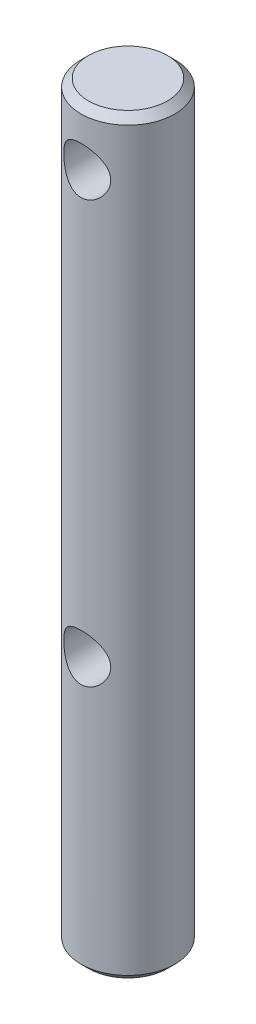
ISO-10303-21;
HEADER;
FILE_DESCRIPTION(('STEP AP214'),'2;1');
FILE_NAME('part.step','',(''),(''),'','','');
FILE_SCHEMA(('AUTOMOTIVE_DESIGN { 1 0 10303 214 1 1 1 1 }'));
ENDSEC;
DATA;
#1=APPLICATION_CONTEXT('core data for automotive mechanical design processes');
#2=APPLICATION_PROTOCOL_DEFINITION('international standard','automotive_design',2000,#1);
#3=PRODUCT_CONTEXT('',#1,'mechanical');
#4=PRODUCT('Part','Part','',(#3));
#5=PRODUCT_RELATED_PRODUCT_CATEGORY('part','',(#4));
#6=PRODUCT_DEFINITION_FORMATION('','',#4);
#7=PRODUCT_DEFINITION_CONTEXT('part definition',#1,'design');
#8=PRODUCT_DEFINITION('design','',#6,#7);
#9=PRODUCT_DEFINITION_SHAPE('','',#8);
#10=(LENGTH_UNIT() NAMED_UNIT(*) SI_UNIT(.MILLI.,.METRE.));
#11=(NAMED_UNIT(*) PLANE_ANGLE_UNIT() SI_UNIT($,.RADIAN.));
#12=(NAMED_UNIT(*) SI_UNIT($,.STERADIAN.) SOLID_ANGLE_UNIT());
#13=UNCERTAINTY_MEASURE_WITH_UNIT(LENGTH_MEASURE(1.E-05),#10,'distance_accuracy_value','');
#14=(GEOMETRIC_REPRESENTATION_CONTEXT(3) GLOBAL_UNCERTAINTY_ASSIGNED_CONTEXT((#13)) GLOBAL_UNIT_ASSIGNED_CONTEXT((#10,
#11,#12)) REPRESENTATION_CONTEXT('',''));
#15=CARTESIAN_POINT('',(0.,0.,0.));
#16=DIRECTION('',(0.,0.,1.));
#17=DIRECTION('',(1.,0.,0.));
#18=AXIS2_PLACEMENT_3D('',#15,#16,#17);
#19=CARTESIAN_POINT('',(0.,50.8,0.));
#20=DIRECTION('',(0.,-1.,0.));
#21=DIRECTION('',(0.,0.,-1.));
#22=AXIS2_PLACEMENT_3D('',#19,#20,#21);
#23=CYLINDRICAL_SURFACE('',#22,3.175);
#24=CARTESIAN_POINT('',(0.,48.5775,-3.175));
#25=CARTESIAN_POINT('',(-0.083457991185083,48.5774947575715,-3.17499545030503));
#26=CARTESIAN_POINT('',(-0.167015477019881,48.5708800089203,-3.17167404493863));
#27=CARTESIAN_POINT('',(-0.331660873489373,48.5447135524578,-3.15871472708987));
#28=CARTESIAN_POINT('',(-0.412743787657887,48.525137276116,-3.1490648192841));
#29=CARTESIAN_POINT('',(-0.569807002497712,48.4740048288211,-3.12445843552858));
#30=CARTESIAN_POINT('',(-0.645805799665895,48.4424952150063,-3.10952259694341));
#31=CARTESIAN_POINT('',(-0.791325279180476,48.3686316385831,-3.07571420218771));
#32=CARTESIAN_POINT('',(-0.860846471709219,48.3262785310049,-3.05684195643221));
#33=CARTESIAN_POINT('',(-0.996168660697032,48.2290163664421,-3.01555559984673));
#34=CARTESIAN_POINT('',(-1.06149014765635,48.1735027142071,-2.99299628614965));
#35=CARTESIAN_POINT('',(-1.18233736872633,48.0527971516953,-2.94735202766705));
#36=CARTESIAN_POINT('',(-1.23785563818199,47.9875979353112,-2.92426669731842));
#37=CARTESIAN_POINT('',(-1.34183755071482,47.8433076826316,-2.87812085025789));
#38=CARTESIAN_POINT('',(-1.38942022018823,47.7635314438759,-2.85520109315084));
#39=CARTESIAN_POINT('',(-1.47029206018898,47.5958418541219,-2.81441491301059));
#40=CARTESIAN_POINT('',(-1.50359144125905,47.5079343706526,-2.79654488326096));
#41=CARTESIAN_POINT('',(-1.55278525197438,47.3318441451427,-2.76951863922521));
#42=CARTESIAN_POINT('',(-1.5696022981152,47.243992932343,-2.75990481139145));
#43=CARTESIAN_POINT('',(-1.58817785187779,47.0662335950251,-2.74926250293288));
#44=CARTESIAN_POINT('',(-1.58995124029225,46.976327591367,-2.7482255383247));
#45=CARTESIAN_POINT('',(-1.57906606838602,46.8085709363994,-2.75448601783382));
#46=CARTESIAN_POINT('',(-1.5681079882647,46.7305643504334,-2.76080162313447));
#47=CARTESIAN_POINT('',(-1.53501701037788,46.5776914688703,-2.77933513114987));
#48=CARTESIAN_POINT('',(-1.51288055293752,46.5028261818278,-2.79155491395445));
#49=CARTESIAN_POINT('',(-1.45765802636278,46.356223752052,-2.82078868805227));
#50=CARTESIAN_POINT('',(-1.42432891904664,46.2846000919276,-2.83790772054098));
#51=CARTESIAN_POINT('',(-1.34785367917295,46.1476180605134,-2.87501654296729));
#52=CARTESIAN_POINT('',(-1.30470313705229,46.0822625222348,-2.89500762088553));
#53=CARTESIAN_POINT('',(-1.20342986217405,45.9509475112701,-2.93867138171466));
#54=CARTESIAN_POINT('',(-1.14410245266123,45.8859622131978,-2.96248947500834));
#55=CARTESIAN_POINT('',(-1.01529448125193,45.7664575229869,-3.00906851989396));
#56=CARTESIAN_POINT('',(-0.945809094811676,45.7119431326462,-3.03182896234596));
#57=CARTESIAN_POINT('',(-0.794569953008056,45.6125490131153,-3.07501904811705));
#58=CARTESIAN_POINT('',(-0.712396326664058,45.5682342499924,-3.09529137357187));
#59=CARTESIAN_POINT('',(-0.540490117088461,45.4944209663942,-3.12988136279972));
#60=CARTESIAN_POINT('',(-0.450763602321123,45.4649106812884,-3.14420375322891));
#61=CARTESIAN_POINT('',(-0.274266805511363,45.4239702965998,-3.16427379814529));
#62=CARTESIAN_POINT('',(-0.187867179745466,45.411245163252,-3.1706333955333));
#63=CARTESIAN_POINT('',(-0.013937614919594,45.400174739324,-3.17615908866327));
#64=CARTESIAN_POINT('',(0.0735917690434815,45.4018226365473,-3.17532859220093));
#65=CARTESIAN_POINT('',(0.240082343027755,45.4187031178648,-3.16692267702328));
#66=CARTESIAN_POINT('',(0.319181810279265,45.4328728957089,-3.15987502529967));
#67=CARTESIAN_POINT('',(0.473720941529333,45.4727279391335,-3.14042696962309));
#68=CARTESIAN_POINT('',(0.549160201034602,45.4984144742449,-3.12802597555879));
#69=CARTESIAN_POINT('',(0.696735665913698,45.5612475654624,-3.09854999119071));
#70=CARTESIAN_POINT('',(0.768715755246715,45.5987007920596,-3.08135149809289));
#71=CARTESIAN_POINT('',(0.905607411697596,45.6836582128389,-3.043935592289));
#72=CARTESIAN_POINT('',(0.970515949770341,45.7311666886702,-3.02371689462514));
#73=CARTESIAN_POINT('',(1.09818120674663,45.8402696752125,-2.97986801371214));
#74=CARTESIAN_POINT('',(1.16010067353771,45.9027893036567,-2.95609779689055));
#75=CARTESIAN_POINT('',(1.27294690977618,46.0373811776534,-2.90929046679002));
#76=CARTESIAN_POINT('',(1.3238660748176,46.1094599761711,-2.88625386997575));
#77=CARTESIAN_POINT('',(1.41558631423544,46.2655343009996,-2.84243767627802));
#78=CARTESIAN_POINT('',(1.45577797458289,46.349937884925,-2.82182140722634));
#79=CARTESIAN_POINT('',(1.52095648617134,46.5256722322753,-2.78723839766939));
#80=CARTESIAN_POINT('',(1.54596292893889,46.6169938982662,-2.77326309427028));
#81=CARTESIAN_POINT('',(1.57775542885366,46.7945949788295,-2.75528882878461));
#82=CARTESIAN_POINT('',(1.58606013179365,46.8805168773284,-2.75046096250791));
#83=CARTESIAN_POINT('',(1.58859403257222,47.0526222191237,-2.74900000493545));
#84=CARTESIAN_POINT('',(1.5828293315144,47.1388055328714,-2.75236336156894));
#85=CARTESIAN_POINT('',(1.55880772437938,47.3003300586843,-2.76602606006084));
#86=CARTESIAN_POINT('',(1.54179319901956,47.3759219963548,-2.7756341249122));
#87=CARTESIAN_POINT('',(1.49729088118125,47.5230953895862,-2.79988988197899));
#88=CARTESIAN_POINT('',(1.46979971971637,47.5946755465711,-2.81453919516849));
#89=CARTESIAN_POINT('',(1.40305749566464,47.7371169509411,-2.84842791953701));
#90=CARTESIAN_POINT('',(1.36314043128242,47.8076067941536,-2.86790959303524));
#91=CARTESIAN_POINT('',(1.27341466747435,47.9413483261878,-2.90886088970341));
#92=CARTESIAN_POINT('',(1.22360082184597,48.0045962222023,-2.93033154400532));
#93=CARTESIAN_POINT('',(1.10839778107492,48.130050396988,-2.97596438013471));
#94=CARTESIAN_POINT('',(1.04185152150814,48.1911963249811,-3.00013660999272));
#95=CARTESIAN_POINT('',(0.898770754895197,48.3016924862035,-3.0460593171264));
#96=CARTESIAN_POINT('',(0.822230898247,48.3510363614085,-3.06780848569085));
#97=CARTESIAN_POINT('',(0.660291409892928,48.4365877258054,-3.10670590186878));
#98=CARTESIAN_POINT('',(0.574832962245561,48.4726998686629,-3.12382053184118));
#99=CARTESIAN_POINT('',(0.398053085556713,48.5295704663149,-3.15120879312142));
#100=CARTESIAN_POINT('',(0.306749131847696,48.5503725568041,-3.1615018583887));
#101=CARTESIAN_POINT('',(0.178755590054295,48.5678121400986,-3.17016545787646));
#102=CARTESIAN_POINT('',(0.143131983613484,48.5714399423753,-3.17197367477648));
#103=CARTESIAN_POINT('',(0.0716783742405832,48.5762850315036,-3.17439193950695));
#104=CARTESIAN_POINT('',(0.0358483656390228,48.5775022518214,-3.17500195426617));
#105=CARTESIAN_POINT('',(0.,48.5775,-3.175));
#106=B_SPLINE_CURVE_WITH_KNOTS('',3,(#24,#25,#26,#27,#28,#29,#30,#31,#32,#33,#34,#35,#36,#37,
#38,#39,#40,#41,#42,#43,#44,#45,#46,#47,#48,#49,#50,#51,#52,#53,#54,#55,#56,#57,#58,#59,#60,#61,
#62,#63,#64,#65,#66,#67,#68,#69,#70,#71,#72,#73,#74,#75,#76,#77,#78,#79,#80,#81,#82,#83,#84,#85,
#86,#87,#88,#89,#90,#91,#92,#93,#94,#95,#96,#97,#98,#99,#100,#101,#102,#103,#104,#105),
.UNSPECIFIED.,.T.,.F.,(4,2,2,2,2,2,2,2,2,2,2,2,2,2,2,2,2,2,2,2,2,2,2,2,2,2,2,2,2,2,2,2,2,2,2,2,
2,2,2,2,4),(0.,0.250228508654714,0.500932687663352,0.750668671844023,1.00038496992324,
1.26520854196497,1.53023290227578,1.8158099070882,2.10118242288521,2.36947094272614,
2.63749404759819,2.87346568449796,3.10951251232015,3.35105756267474,3.59271127500602,
3.86500594367532,4.13743036175415,4.42250547765424,4.70735369348243,4.96860973623261,
5.22974196161968,5.47063464078468,5.71155388089103,5.95936158944289,6.20727503062988,
6.47953381898015,6.75198021926997,7.03762057931739,7.32289162713402,7.58077775661086,
7.83855207535177,8.07176964270058,8.30506226951507,8.55402875138706,8.80312503315514,
9.08248822877009,9.36200158617726,9.64349121690847,9.92417542436073,10.0316550721259,
10.1391376863632),.UNSPECIFIED.);
#107=CARTESIAN_POINT('',(0.,48.5775,-3.175));
#108=VERTEX_POINT('',#107);
#109=EDGE_CURVE('E39',#108,#108,#106,.T.);
#110=ORIENTED_EDGE('',*,*,#109,.T.);
#111=EDGE_LOOP('',(#110));
#112=FACE_BOUND('',#111,.T.);
#113=CARTESIAN_POINT('',(1.5875,46.99,2.74963065701559));
#114=CARTESIAN_POINT('',(1.58749422638082,46.90727885449,2.74963786381429));
#115=CARTESIAN_POINT('',(1.58099120353898,46.824453259204,2.75342034385563));
#116=CARTESIAN_POINT('',(1.55531059571316,46.661344217325,2.76800256742633));
#117=CARTESIAN_POINT('',(1.53610637747976,46.5810664848686,2.77881705563201));
#118=CARTESIAN_POINT('',(1.48605866856095,46.425720482854,2.8058958773607));
#119=CARTESIAN_POINT('',(1.4552770495838,46.3506269891982,2.82213119013788));
#120=CARTESIAN_POINT('',(1.38313719653499,46.2066890793302,2.85817730396762));
#121=CARTESIAN_POINT('',(1.34177839028179,46.1378450014584,2.87798829843252));
#122=CARTESIAN_POINT('',(1.24565813309277,46.002089655915,2.92095029628688));
#123=CARTESIAN_POINT('',(1.19007260737824,45.9358061221183,2.94424201025251));
#124=CARTESIAN_POINT('',(1.06879041958797,45.8130141834043,2.99040522672308));
#125=CARTESIAN_POINT('',(1.00308874467939,45.7565106543987,3.01327651457109));
#126=CARTESIAN_POINT('',(0.858027181920594,45.6511546475531,3.05786594662806));
#127=CARTESIAN_POINT('',(0.778045162557466,45.603074643523,3.07940243938849));
#128=CARTESIAN_POINT('',(0.609849279726715,45.5213388954723,3.11706825308002));
#129=CARTESIAN_POINT('',(0.521640654294323,45.4876740483822,3.1332009850419));
#130=CARTESIAN_POINT('',(0.346146348482491,45.4382113501845,3.15722732225227));
#131=CARTESIAN_POINT('',(0.259241592401001,45.4213126269106,3.16562549850666));
#132=CARTESIAN_POINT('',(0.0834558730578376,45.4022362866034,3.17512039355631));
#133=CARTESIAN_POINT('',(-0.0054238617769311,45.4000497623368,3.17622153020536));
#134=CARTESIAN_POINT('',(-0.1743591325227,45.4100353449279,3.17123733792365));
#135=CARTESIAN_POINT('',(-0.254509903693154,45.4209753496399,3.16576862228805));
#136=CARTESIAN_POINT('',(-0.411660612920334,45.4546983396986,3.14919114349849));
#137=CARTESIAN_POINT('',(-0.488660314736604,45.4774822112498,3.138081958304));
#138=CARTESIAN_POINT('',(-0.638666159116664,45.5343935736676,3.11104888469151));
#139=CARTESIAN_POINT('',(-0.711602309830344,45.5686736471607,3.09506050927604));
#140=CARTESIAN_POINT('',(-0.850863172402407,45.6473931732199,3.05971013003866));
#141=CARTESIAN_POINT('',(-0.917185505031348,45.6918362629925,3.04034691900006));
#142=CARTESIAN_POINT('',(-1.04802568667588,45.7944463705587,2.99790476108776));
#143=CARTESIAN_POINT('',(-1.1117803441091,45.8535135574675,2.97464759397103));
#144=CARTESIAN_POINT('',(-1.22889068784772,45.9812861883266,2.92821265681564));
#145=CARTESIAN_POINT('',(-1.28223837337409,46.0499989784851,2.90503496121686));
#146=CARTESIAN_POINT('',(-1.38033971874451,46.2004540054732,2.85978847796819));
#147=CARTESIAN_POINT('',(-1.42433248752765,46.2827465615986,2.83788357985248));
#148=CARTESIAN_POINT('',(-1.49751909188945,46.4549135532824,2.79996027317239));
#149=CARTESIAN_POINT('',(-1.52672836990979,46.5447799624154,2.78393572698132));
#150=CARTESIAN_POINT('',(-1.56714858500225,46.7220530366614,2.76137109359542));
#151=CARTESIAN_POINT('',(-1.57960238136546,46.8090902764816,2.75418003659488));
#152=CARTESIAN_POINT('',(-1.58990815274564,46.9842871296575,2.74824696986555));
#153=CARTESIAN_POINT('',(-1.5877704422376,47.0724459062277,2.74949899186782));
#154=CARTESIAN_POINT('',(-1.57009471880854,47.2371005957437,2.75962009258178));
#155=CARTESIAN_POINT('',(-1.55604815903104,47.3138173786338,2.76764095166814));
#156=CARTESIAN_POINT('',(-1.517167851854,47.4636588607051,2.78914259212754));
#157=CARTESIAN_POINT('',(-1.49233061106499,47.5367823880602,2.80262514157991));
#158=CARTESIAN_POINT('',(-1.43136554691026,47.681215487808,2.83426252551455));
#159=CARTESIAN_POINT('',(-1.3947680761122,47.752284189255,2.85260483648363));
#160=CARTESIAN_POINT('',(-1.31173071412509,47.8876824685682,2.89172839701884));
#161=CARTESIAN_POINT('',(-1.26528576687739,47.9520085590773,2.91251089701297));
#162=CARTESIAN_POINT('',(-1.15702900292818,48.0805787934436,2.95732197549433));
#163=CARTESIAN_POINT('',(-1.09401811980001,48.1437904767643,2.98142950757434));
#164=CARTESIAN_POINT('',(-0.957904636444784,48.2590669278148,3.02790598027404));
#165=CARTESIAN_POINT('',(-0.884798641015365,48.311127930241,3.05027433199738));
#166=CARTESIAN_POINT('',(-0.727924888062029,48.4037857899458,3.09151911684394));
#167=CARTESIAN_POINT('',(-0.643926667398906,48.4440438251598,3.11028781154346));
#168=CARTESIAN_POINT('',(-0.469141753867718,48.5094564223736,3.1413982599789));
#169=CARTESIAN_POINT('',(-0.37836110096008,48.534624246544,3.15374565586242));
#170=CARTESIAN_POINT('',(-0.201580245699537,48.5669725956273,3.16972169238739));
#171=CARTESIAN_POINT('',(-0.1159056671126,48.5755916279533,3.17404635554254));
#172=CARTESIAN_POINT('',(0.0557625026975351,48.5788386839089,3.17566881970521));
#173=CARTESIAN_POINT('',(0.141755971718449,48.5734716052811,3.17296908056188));
#174=CARTESIAN_POINT('',(0.30565406280347,48.5498514542119,3.16125175530202));
#175=CARTESIAN_POINT('',(0.383718304525382,48.5324708018034,3.15266220285434));
#176=CARTESIAN_POINT('',(0.535695449091493,48.4864933886065,3.13042448690684));
#177=CARTESIAN_POINT('',(0.609607754866869,48.4578950193516,3.11677559798313));
#178=CARTESIAN_POINT('',(0.754734657413753,48.3890208046865,3.08492415062641));
#179=CARTESIAN_POINT('',(0.825698664036324,48.3482978244075,3.06655179803093));
#180=CARTESIAN_POINT('',(0.960079743879765,48.2568917847613,3.02717411362649));
#181=CARTESIAN_POINT('',(1.02349332927116,48.2062041507789,3.00616757411397));
#182=CARTESIAN_POINT('',(1.14762598159906,48.0904595418015,2.96114168734771));
#183=CARTESIAN_POINT('',(1.20744882420609,48.0244745511299,2.93703055931071));
#184=CARTESIAN_POINT('',(1.31550296873904,47.8830469802065,2.89025133408528));
#185=CARTESIAN_POINT('',(1.36372401564097,47.8075961218726,2.86758452646961));
#186=CARTESIAN_POINT('',(1.44848433915973,47.6462143235527,2.82574373421554));
#187=CARTESIAN_POINT('',(1.48460629221299,47.5600275443331,2.80670276631829));
#188=CARTESIAN_POINT('',(1.54126995134143,47.3815848081106,2.77600023171258));
#189=CARTESIAN_POINT('',(1.56186376599086,47.2893502888511,2.76431400634477));
#190=CARTESIAN_POINT('',(1.57855762498476,47.1617589979024,2.75477720255342));
#191=CARTESIAN_POINT('',(1.58190581663011,47.1275284676434,2.75285404795678));
#192=CARTESIAN_POINT('',(1.58637828058031,47.0588713369169,2.75027923221803));
#193=CARTESIAN_POINT('',(1.58750240410979,47.0244447234874,2.74962765613611));
#194=CARTESIAN_POINT('',(1.5875,46.99,2.74963065701559));
#195=B_SPLINE_CURVE_WITH_KNOTS('',3,(#113,#114,#115,#116,#117,#118,#119,#120,#121,#122,#123,
#124,#125,#126,#127,#128,#129,#130,#131,#132,#133,#134,#135,#136,#137,#138,#139,#140,#141,#142,
#143,#144,#145,#146,#147,#148,#149,#150,#151,#152,#153,#154,#155,#156,#157,#158,#159,#160,#161,
#162,#163,#164,#165,#166,#167,#168,#169,#170,#171,#172,#173,#174,#175,#176,#177,#178,#179,#180,
#181,#182,#183,#184,#185,#186,#187,#188,#189,#190,#191,#192,#193,#194),.UNSPECIFIED.,.T.,.F.,(4,
2,2,2,2,2,2,2,2,2,2,2,2,2,2,2,2,2,2,2,2,2,2,2,2,2,2,2,2,2,2,2,2,2,2,2,2,2,2,2,4),(0.,
0.248018494619114,0.496558717359377,0.743789146021224,0.991032951644172,1.25866892109094,
1.52643794096438,1.81225653929037,2.09789437805177,2.36320782386597,2.62836062601588,
2.87045554756704,3.1125685862146,3.35803136385695,3.60358212718556,3.87234416437813,
4.14131201590395,4.42736036245499,4.71310929061081,4.97621386731062,5.23913247936542,
5.4732901618564,5.70752370742249,5.95260583044664,6.19781409374325,6.47393205434223,
6.75014310652895,7.03364387993082,7.31689512946424,7.5741572924331,7.83132937785429,
8.07155524483494,8.3118155695032,8.56235191767161,8.81300355284891,9.08860008936981,
9.36443934266681,9.64899564098785,9.93259273641882,10.0358596460668,10.1391334633508),.UNSPECIFIED.);
#196=CARTESIAN_POINT('',(1.5875,46.99,2.74963065701559));
#197=VERTEX_POINT('',#196);
#198=EDGE_CURVE('E98',#197,#197,#195,.T.);
#199=ORIENTED_EDGE('',*,*,#198,.T.);
#200=EDGE_LOOP('',(#199));
#201=FACE_BOUND('',#200,.T.);
#202=CARTESIAN_POINT('',(0.,20.066,-3.175));
#203=CARTESIAN_POINT('',(-0.0834579911850833,20.0659947575714,-3.17499545030503));
#204=CARTESIAN_POINT('',(-0.167015477019881,20.0593800089203,-3.17167404493863));
#205=CARTESIAN_POINT('',(-0.331660873489373,20.0332135524578,-3.15871472708987));
#206=CARTESIAN_POINT('',(-0.412743787657887,20.013637276116,-3.1490648192841));
#207=CARTESIAN_POINT('',(-0.569807002497711,19.9625048288211,-3.12445843552858));
#208=CARTESIAN_POINT('',(-0.645805799665893,19.9309952150063,-3.10952259694341));
#209=CARTESIAN_POINT('',(-0.791325279180473,19.8571316385831,-3.07571420218771));
#210=CARTESIAN_POINT('',(-0.860846471709217,19.8147785310049,-3.05684195643221));
#211=CARTESIAN_POINT('',(-0.99616866069703,19.7175163664421,-3.01555559984673));
#212=CARTESIAN_POINT('',(-1.06149014765635,19.6620027142071,-2.99299628614965));
#213=CARTESIAN_POINT('',(-1.18233736872633,19.5412971516953,-2.94735202766705));
#214=CARTESIAN_POINT('',(-1.23785563818199,19.4760979353112,-2.92426669731842));
#215=CARTESIAN_POINT('',(-1.34183755071482,19.3318076826316,-2.87812085025789));
#216=CARTESIAN_POINT('',(-1.38942022018822,19.2520314438759,-2.85520109315084));
#217=CARTESIAN_POINT('',(-1.47029206018898,19.0843418541219,-2.81441491301059));
#218=CARTESIAN_POINT('',(-1.50359144125905,18.9964343706526,-2.79654488326096));
#219=CARTESIAN_POINT('',(-1.55278525197438,18.8203441451427,-2.76951863922521));
#220=CARTESIAN_POINT('',(-1.5696022981152,18.732492932343,-2.75990481139145));
#221=CARTESIAN_POINT('',(-1.58817785187779,18.5547335950251,-2.74926250293288));
#222=CARTESIAN_POINT('',(-1.58995124029225,18.464827591367,-2.7482255383247));
#223=CARTESIAN_POINT('',(-1.57906606838602,18.2970709363994,-2.75448601783382));
#224=CARTESIAN_POINT('',(-1.5681079882647,18.2190643504334,-2.76080162313447));
#225=CARTESIAN_POINT('',(-1.53501701037788,18.0661914688703,-2.77933513114987));
#226=CARTESIAN_POINT('',(-1.51288055293752,17.9913261818278,-2.79155491395445));
#227=CARTESIAN_POINT('',(-1.45765802636278,17.844723752052,-2.82078868805226));
#228=CARTESIAN_POINT('',(-1.42432891904664,17.7731000919276,-2.83790772054098));
#229=CARTESIAN_POINT('',(-1.34785367917295,17.6361180605134,-2.87501654296728));
#230=CARTESIAN_POINT('',(-1.30470313705229,17.5707625222349,-2.89500762088552));
#231=CARTESIAN_POINT('',(-1.20342986217405,17.4394475112701,-2.93867138171466));
#232=CARTESIAN_POINT('',(-1.14410245266124,17.3744622131978,-2.96248947500834));
#233=CARTESIAN_POINT('',(-1.01529448125193,17.2549575229869,-3.00906851989396));
#234=CARTESIAN_POINT('',(-0.945809094811678,17.2004431326462,-3.03182896234596));
#235=CARTESIAN_POINT('',(-0.79456995300806,17.1010490131153,-3.07501904811705));
#236=CARTESIAN_POINT('',(-0.712396326664062,17.0567342499924,-3.09529137357186));
#237=CARTESIAN_POINT('',(-0.540490117088466,16.9829209663942,-3.12988136279972));
#238=CARTESIAN_POINT('',(-0.450763602321126,16.9534106812884,-3.14420375322891));
#239=CARTESIAN_POINT('',(-0.274266805511365,16.9124702965998,-3.16427379814529));
#240=CARTESIAN_POINT('',(-0.187867179745468,16.899745163252,-3.1706333955333));
#241=CARTESIAN_POINT('',(-0.0139376149195961,16.888674739324,-3.17615908866327));
#242=CARTESIAN_POINT('',(0.0735917690434799,16.8903226365473,-3.17532859220093));
#243=CARTESIAN_POINT('',(0.240082343027754,16.9072031178648,-3.16692267702328));
#244=CARTESIAN_POINT('',(0.319181810279264,16.9213728957089,-3.15987502529967));
#245=CARTESIAN_POINT('',(0.473720941529331,16.9612279391335,-3.14042696962309));
#246=CARTESIAN_POINT('',(0.5491602010346,16.9869144742449,-3.12802597555879));
#247=CARTESIAN_POINT('',(0.696735665913696,17.0497475654624,-3.09854999119071));
#248=CARTESIAN_POINT('',(0.768715755246711,17.0872007920596,-3.08135149809289));
#249=CARTESIAN_POINT('',(0.905607411697592,17.1721582128389,-3.043935592289));
#250=CARTESIAN_POINT('',(0.970515949770337,17.2196666886702,-3.02371689462515));
#251=CARTESIAN_POINT('',(1.09818120674663,17.3287696752125,-2.97986801371214));
#252=CARTESIAN_POINT('',(1.1601006735377,17.3912893036567,-2.95609779689055));
#253=CARTESIAN_POINT('',(1.27294690977618,17.5258811776534,-2.90929046679002));
#254=CARTESIAN_POINT('',(1.3238660748176,17.5979599761711,-2.88625386997575));
#255=CARTESIAN_POINT('',(1.41558631423544,17.7540343009996,-2.84243767627802));
#256=CARTESIAN_POINT('',(1.45577797458289,17.838437884925,-2.82182140722634));
#257=CARTESIAN_POINT('',(1.52095648617134,18.0141722322753,-2.78723839766939));
#258=CARTESIAN_POINT('',(1.54596292893889,18.1054938982662,-2.77326309427028));
#259=CARTESIAN_POINT('',(1.57775542885366,18.2830949788295,-2.75528882878461));
#260=CARTESIAN_POINT('',(1.58606013179365,18.3690168773284,-2.75046096250791));
#261=CARTESIAN_POINT('',(1.58859403257222,18.5411222191237,-2.74900000493545));
#262=CARTESIAN_POINT('',(1.5828293315144,18.6273055328714,-2.75236336156894));
#263=CARTESIAN_POINT('',(1.55880772437938,18.7888300586843,-2.76602606006084));
#264=CARTESIAN_POINT('',(1.54179319901956,18.8644219963548,-2.7756341249122));
#265=CARTESIAN_POINT('',(1.49729088118125,19.0115953895862,-2.79988988197899));
#266=CARTESIAN_POINT('',(1.46979971971638,19.0831755465711,-2.81453919516849));
#267=CARTESIAN_POINT('',(1.40305749566465,19.2256169509411,-2.848427919537));
#268=CARTESIAN_POINT('',(1.36314043128242,19.2961067941536,-2.86790959303524));
#269=CARTESIAN_POINT('',(1.27341466747436,19.4298483261877,-2.90886088970341));
#270=CARTESIAN_POINT('',(1.22360082184598,19.4930962222023,-2.93033154400532));
#271=CARTESIAN_POINT('',(1.10839778107493,19.618550396988,-2.97596438013471));
#272=CARTESIAN_POINT('',(1.04185152150815,19.6796963249811,-3.00013660999272));
#273=CARTESIAN_POINT('',(0.898770754895199,19.7901924862035,-3.0460593171264));
#274=CARTESIAN_POINT('',(0.822230898247,19.8395363614085,-3.06780848569085));
#275=CARTESIAN_POINT('',(0.660291409892926,19.9250877258054,-3.10670590186878));
#276=CARTESIAN_POINT('',(0.574832962245559,19.9611998686629,-3.12382053184118));
#277=CARTESIAN_POINT('',(0.398053085556712,20.0180704663149,-3.15120879312142));
#278=CARTESIAN_POINT('',(0.306749131847696,20.0388725568041,-3.1615018583887));
#279=CARTESIAN_POINT('',(0.178755590054296,20.0563121400986,-3.17016545787646));
#280=CARTESIAN_POINT('',(0.143131983613485,20.0599399423753,-3.17197367477648));
#281=CARTESIAN_POINT('',(0.0716783742405836,20.0647850315036,-3.17439193950695));
#282=CARTESIAN_POINT('',(0.035848365639023,20.0660022518215,-3.17500195426617));
#283=CARTESIAN_POINT('',(0.,20.066,-3.175));
#284=B_SPLINE_CURVE_WITH_KNOTS('',3,(#202,#203,#204,#205,#206,#207,#208,#209,#210,#211,#212,
#213,#214,#215,#216,#217,#218,#219,#220,#221,#222,#223,#224,#225,#226,#227,#228,#229,#230,#231,
#232,#233,#234,#235,#236,#237,#238,#239,#240,#241,#242,#243,#244,#245,#246,#247,#248,#249,#250,
#251,#252,#253,#254,#255,#256,#257,#258,#259,#260,#261,#262,#263,#264,#265,#266,#267,#268,#269,
#270,#271,#272,#273,#274,#275,#276,#277,#278,#279,#280,#281,#282,#283),.UNSPECIFIED.,.T.,.F.,(4,
2,2,2,2,2,2,2,2,2,2,2,2,2,2,2,2,2,2,2,2,2,2,2,2,2,2,2,2,2,2,2,2,2,2,2,2,2,2,2,4),(0.,
0.250228508654715,0.50093268766335,0.750668671844021,1.00038496992324,1.26520854196497,
1.53023290227578,1.8158099070882,2.10118242288521,2.36947094272614,2.63749404759819,
2.87346568449796,3.10951251232014,3.35105756267473,3.59271127500602,3.86500594367532,
4.13743036175414,4.42250547765424,4.70735369348243,4.96860973623261,5.22974196161968,
5.47063464078468,5.71155388089103,5.95936158944288,6.20727503062988,6.47953381898014,
6.75198021926997,7.03762057931739,7.32289162713403,7.58077775661086,7.83855207535176,
8.07176964270058,8.30506226951507,8.55402875138705,8.80312503315513,9.08248822877009,
9.36200158617727,9.64349121690848,9.92417542436074,10.0316550721259,10.1391376863632),.UNSPECIFIED.);
#285=CARTESIAN_POINT('',(0.,20.066,-3.175));
#286=VERTEX_POINT('',#285);
#287=EDGE_CURVE('E64',#286,#286,#284,.T.);
#288=ORIENTED_EDGE('',*,*,#287,.T.);
#289=EDGE_LOOP('',(#288));
#290=FACE_BOUND('',#289,.T.);
#291=CARTESIAN_POINT('',(1.5875,18.4785,2.74963065701559));
#292=CARTESIAN_POINT('',(1.58749422638082,18.39577885449,2.74963786381429));
#293=CARTESIAN_POINT('',(1.58099120353898,18.312953259204,2.75342034385563));
#294=CARTESIAN_POINT('',(1.55531059571316,18.149844217325,2.76800256742633));
#295=CARTESIAN_POINT('',(1.53610637747976,18.0695664848686,2.77881705563201));
#296=CARTESIAN_POINT('',(1.48605866856095,17.914220482854,2.8058958773607));
#297=CARTESIAN_POINT('',(1.4552770495838,17.8391269891982,2.82213119013788));
#298=CARTESIAN_POINT('',(1.38313719653499,17.6951890793302,2.85817730396762));
#299=CARTESIAN_POINT('',(1.34177839028179,17.6263450014584,2.87798829843253));
#300=CARTESIAN_POINT('',(1.24565813309277,17.490589655915,2.92095029628688));
#301=CARTESIAN_POINT('',(1.19007260737824,17.4243061221182,2.94424201025251));
#302=CARTESIAN_POINT('',(1.06879041958797,17.3015141834043,2.99040522672308));
#303=CARTESIAN_POINT('',(1.00308874467939,17.2450106543987,3.01327651457109));
#304=CARTESIAN_POINT('',(0.858027181920591,17.1396546475531,3.05786594662807));
#305=CARTESIAN_POINT('',(0.778045162557461,17.091574643523,3.07940243938849));
#306=CARTESIAN_POINT('',(0.609849279726712,17.0098388954724,3.11706825308002));
#307=CARTESIAN_POINT('',(0.521640654294321,16.9761740483822,3.1332009850419));
#308=CARTESIAN_POINT('',(0.346146348482488,16.9267113501845,3.15722732225227));
#309=CARTESIAN_POINT('',(0.259241592400997,16.9098126269106,3.16562549850666));
#310=CARTESIAN_POINT('',(0.0834558730578336,16.8907362866034,3.17512039355631));
#311=CARTESIAN_POINT('',(-0.00542386177693499,16.8885497623368,3.17622153020536));
#312=CARTESIAN_POINT('',(-0.174359132522703,16.8985353449279,3.17123733792365));
#313=CARTESIAN_POINT('',(-0.254509903693156,16.9094753496399,3.16576862228805));
#314=CARTESIAN_POINT('',(-0.411660612920336,16.9431983396986,3.14919114349849));
#315=CARTESIAN_POINT('',(-0.488660314736606,16.9659822112498,3.138081958304));
#316=CARTESIAN_POINT('',(-0.638666159116666,17.0228935736676,3.11104888469151));
#317=CARTESIAN_POINT('',(-0.711602309830346,17.0571736471607,3.09506050927604));
#318=CARTESIAN_POINT('',(-0.850863172402409,17.1358931732199,3.05971013003866));
#319=CARTESIAN_POINT('',(-0.91718550503135,17.1803362629925,3.04034691900006));
#320=CARTESIAN_POINT('',(-1.04802568667588,17.2829463705587,2.99790476108776));
#321=CARTESIAN_POINT('',(-1.11178034410911,17.3420135574675,2.97464759397103));
#322=CARTESIAN_POINT('',(-1.22889068784773,17.4697861883267,2.92821265681563));
#323=CARTESIAN_POINT('',(-1.28223837337409,17.5384989784851,2.90503496121686));
#324=CARTESIAN_POINT('',(-1.38033971874451,17.6889540054732,2.85978847796819));
#325=CARTESIAN_POINT('',(-1.42433248752766,17.7712465615986,2.83788357985248));
#326=CARTESIAN_POINT('',(-1.49751909188945,17.9434135532824,2.79996027317239));
#327=CARTESIAN_POINT('',(-1.52672836990979,18.0332799624154,2.78393572698132));
#328=CARTESIAN_POINT('',(-1.56714858500225,18.2105530366614,2.76137109359542));
#329=CARTESIAN_POINT('',(-1.57960238136546,18.2975902764816,2.75418003659488));
#330=CARTESIAN_POINT('',(-1.58990815274564,18.4727871296575,2.74824696986555));
#331=CARTESIAN_POINT('',(-1.5877704422376,18.5609459062277,2.74949899186782));
#332=CARTESIAN_POINT('',(-1.57009471880855,18.7256005957437,2.75962009258178));
#333=CARTESIAN_POINT('',(-1.55604815903104,18.8023173786338,2.76764095166813));
#334=CARTESIAN_POINT('',(-1.517167851854,18.9521588607051,2.78914259212754));
#335=CARTESIAN_POINT('',(-1.49233061106499,19.0252823880602,2.80262514157991));
#336=CARTESIAN_POINT('',(-1.43136554691026,19.169715487808,2.83426252551455));
#337=CARTESIAN_POINT('',(-1.3947680761122,19.240784189255,2.85260483648363));
#338=CARTESIAN_POINT('',(-1.31173071412509,19.3761824685681,2.89172839701884));
#339=CARTESIAN_POINT('',(-1.26528576687739,19.4405085590773,2.91251089701297));
#340=CARTESIAN_POINT('',(-1.15702900292818,19.5690787934436,2.95732197549433));
#341=CARTESIAN_POINT('',(-1.09401811980001,19.6322904767643,2.98142950757434));
#342=CARTESIAN_POINT('',(-0.957904636444783,19.7475669278148,3.02790598027404));
#343=CARTESIAN_POINT('',(-0.884798641015363,19.799627930241,3.05027433199738));
#344=CARTESIAN_POINT('',(-0.727924888062027,19.8922857899458,3.09151911684394));
#345=CARTESIAN_POINT('',(-0.643926667398905,19.9325438251598,3.11028781154346));
#346=CARTESIAN_POINT('',(-0.469141753867718,19.9979564223736,3.1413982599789));
#347=CARTESIAN_POINT('',(-0.378361100960079,20.023124246544,3.15374565586242));
#348=CARTESIAN_POINT('',(-0.201580245699536,20.0554725956273,3.16972169238739));
#349=CARTESIAN_POINT('',(-0.1159056671126,20.0640916279533,3.17404635554254));
#350=CARTESIAN_POINT('',(0.0557625026975361,20.0673386839089,3.17566881970521));
#351=CARTESIAN_POINT('',(0.141755971718451,20.0619716052812,3.17296908056188));
#352=CARTESIAN_POINT('',(0.305654062803471,20.0383514542119,3.16125175530202));
#353=CARTESIAN_POINT('',(0.38371830452538,20.0209708018034,3.15266220285434));
#354=CARTESIAN_POINT('',(0.535695449091492,19.9749933886065,3.13042448690684));
#355=CARTESIAN_POINT('',(0.60960775486687,19.9463950193516,3.11677559798313));
#356=CARTESIAN_POINT('',(0.754734657413754,19.8775208046865,3.08492415062641));
#357=CARTESIAN_POINT('',(0.825698664036323,19.8367978244076,3.06655179803093));
#358=CARTESIAN_POINT('',(0.960079743879764,19.7453917847613,3.02717411362649));
#359=CARTESIAN_POINT('',(1.02349332927117,19.6947041507789,3.00616757411397));
#360=CARTESIAN_POINT('',(1.14762598159906,19.5789595418015,2.96114168734771));
#361=CARTESIAN_POINT('',(1.20744882420609,19.51297455113,2.9370305593107));
#362=CARTESIAN_POINT('',(1.31550296873905,19.3715469802065,2.89025133408528));
#363=CARTESIAN_POINT('',(1.36372401564097,19.2960961218725,2.86758452646961));
#364=CARTESIAN_POINT('',(1.44848433915972,19.1347143235527,2.82574373421554));
#365=CARTESIAN_POINT('',(1.48460629221299,19.0485275443331,2.80670276631829));
#366=CARTESIAN_POINT('',(1.54126995134143,18.8700848081106,2.77600023171258));
#367=CARTESIAN_POINT('',(1.56186376599086,18.7778502888511,2.76431400634477));
#368=CARTESIAN_POINT('',(1.57855762498476,18.6502589979025,2.75477720255342));
#369=CARTESIAN_POINT('',(1.58190581663011,18.6160284676434,2.75285404795678));
#370=CARTESIAN_POINT('',(1.58637828058032,18.5473713369169,2.75027923221803));
#371=CARTESIAN_POINT('',(1.58750240410979,18.5129447234874,2.74962765613611));
#372=CARTESIAN_POINT('',(1.5875,18.4785,2.74963065701559));
#373=B_SPLINE_CURVE_WITH_KNOTS('',3,(#291,#292,#293,#294,#295,#296,#297,#298,#299,#300,#301,
#302,#303,#304,#305,#306,#307,#308,#309,#310,#311,#312,#313,#314,#315,#316,#317,#318,#319,#320,
#321,#322,#323,#324,#325,#326,#327,#328,#329,#330,#331,#332,#333,#334,#335,#336,#337,#338,#339,
#340,#341,#342,#343,#344,#345,#346,#347,#348,#349,#350,#351,#352,#353,#354,#355,#356,#357,#358,
#359,#360,#361,#362,#363,#364,#365,#366,#367,#368,#369,#370,#371,#372),.UNSPECIFIED.,.T.,.F.,(4,
2,2,2,2,2,2,2,2,2,2,2,2,2,2,2,2,2,2,2,2,2,2,2,2,2,2,2,2,2,2,2,2,2,2,2,2,2,2,2,4),(0.,
0.24801849461911,0.496558717359377,0.743789146021232,0.991032951644174,1.25866892109094,
1.52643794096439,1.81225653929037,2.09789437805177,2.36320782386597,2.62836062601588,
2.87045554756704,3.1125685862146,3.35803136385695,3.60358212718556,3.87234416437814,
4.14131201590396,4.42736036245499,4.71310929061081,4.97621386731061,5.23913247936542,
5.4732901618564,5.7075237074225,5.95260583044664,6.19781409374325,6.47393205434223,
6.75014310652895,7.03364387993083,7.31689512946424,7.5741572924331,7.83132937785429,
8.07155524483494,8.3118155695032,8.56235191767161,8.81300355284891,9.08860008936981,
9.36443934266682,9.64899564098784,9.93259273641881,10.0358596460668,10.1391334633508),.UNSPECIFIED.);
#374=CARTESIAN_POINT('',(1.5875,18.4785,2.74963065701559));
#375=VERTEX_POINT('',#374);
#376=EDGE_CURVE('E57',#375,#375,#373,.T.);
#377=ORIENTED_EDGE('',*,*,#376,.T.);
#378=EDGE_LOOP('',(#377));
#379=FACE_BOUND('',#378,.T.);
#380=CARTESIAN_POINT('',(0.,0.508000000000015,0.));
#381=DIRECTION('',(0.,1.,0.));
#382=DIRECTION('',(0.,0.,1.));
#383=AXIS2_PLACEMENT_3D('',#380,#381,#382);
#384=CIRCLE('',#383,3.175);
#385=CARTESIAN_POINT('',(0.,0.508000000000015,3.175));
#386=VERTEX_POINT('',#385);
#387=EDGE_CURVE('E53',#386,#386,#384,.T.);
#388=ORIENTED_EDGE('',*,*,#387,.T.);
#389=EDGE_LOOP('',(#388));
#390=FACE_BOUND('',#389,.T.);
#391=CARTESIAN_POINT('',(0.,50.292,0.));
#392=DIRECTION('',(0.,1.,0.));
#393=DIRECTION('',(0.,0.,1.));
#394=AXIS2_PLACEMENT_3D('',#391,#392,#393);
#395=CIRCLE('',#394,3.175);
#396=CARTESIAN_POINT('',(0.,50.292,3.175));
#397=VERTEX_POINT('',#396);
#398=EDGE_CURVE('E109',#397,#397,#395,.F.);
#399=ORIENTED_EDGE('',*,*,#398,.T.);
#400=EDGE_LOOP('',(#399));
#401=FACE_BOUND('',#400,.T.);
#402=ADVANCED_FACE('F34',(#112,#201,#290,#379,#390,#401),#23,.T.);
#403=CARTESIAN_POINT('',(0.,50.8,0.));
#404=DIRECTION('',(0.,1.,0.));
#405=DIRECTION('',(0.,0.,1.));
#406=AXIS2_PLACEMENT_3D('',#403,#404,#405);
#407=PLANE('',#406);
#408=CARTESIAN_POINT('',(0.,50.8,0.));
#409=DIRECTION('',(0.,1.,0.));
#410=DIRECTION('',(0.,0.,1.));
#411=AXIS2_PLACEMENT_3D('',#408,#409,#410);
#412=CIRCLE('',#411,2.667);
#413=CARTESIAN_POINT('',(0.,50.8,2.667));
#414=VERTEX_POINT('',#413);
#415=EDGE_CURVE('E10',#414,#414,#412,.T.);
#416=ORIENTED_EDGE('',*,*,#415,.T.);
#417=EDGE_LOOP('',(#416));
#418=FACE_BOUND('',#417,.T.);
#419=ADVANCED_FACE('F77',(#418),#407,.T.);
#420=CARTESIAN_POINT('',(0.,0.,0.));
#421=DIRECTION('',(0.,1.,0.));
#422=DIRECTION('',(0.,0.,1.));
#423=AXIS2_PLACEMENT_3D('',#420,#421,#422);
#424=PLANE('',#423);
#425=CARTESIAN_POINT('',(0.,0.,0.));
#426=DIRECTION('',(0.,1.,0.));
#427=DIRECTION('',(0.,0.,1.));
#428=AXIS2_PLACEMENT_3D('',#425,#426,#427);
#429=CIRCLE('',#428,2.66699999999998);
#430=CARTESIAN_POINT('',(0.,0.,2.66699999999998));
#431=VERTEX_POINT('',#430);
#432=EDGE_CURVE('E48',#431,#431,#429,.F.);
#433=ORIENTED_EDGE('',*,*,#432,.T.);
#434=EDGE_LOOP('',(#433));
#435=FACE_BOUND('',#434,.T.);
#436=ADVANCED_FACE('F80',(#435),#424,.F.);
#437=CARTESIAN_POINT('',(0.,0.508000000000015,0.));
#438=DIRECTION('',(0.,1.,0.));
#439=DIRECTION('',(0.,0.,1.));
#440=AXIS2_PLACEMENT_3D('',#437,#438,#439);
#441=CONICAL_SURFACE('',#440,3.175,0.78539816339745);
#442=ORIENTED_EDGE('',*,*,#432,.F.);
#443=EDGE_LOOP('',(#442));
#444=FACE_BOUND('',#443,.T.);
#445=ORIENTED_EDGE('',*,*,#387,.F.);
#446=EDGE_LOOP('',(#445));
#447=FACE_BOUND('',#446,.T.);
#448=ADVANCED_FACE('F82',(#444,#447),#441,.T.);
#449=CARTESIAN_POINT('',(0.,50.8,0.));
#450=DIRECTION('',(0.,-1.,0.));
#451=DIRECTION('',(0.,0.,-1.));
#452=AXIS2_PLACEMENT_3D('',#449,#450,#451);
#453=CONICAL_SURFACE('',#452,2.667,0.785398163397451);
#454=ORIENTED_EDGE('',*,*,#398,.F.);
#455=EDGE_LOOP('',(#454));
#456=FACE_BOUND('',#455,.T.);
#457=ORIENTED_EDGE('',*,*,#415,.F.);
#458=EDGE_LOOP('',(#457));
#459=FACE_BOUND('',#458,.T.);
#460=ADVANCED_FACE('F37',(#456,#459),#453,.T.);
#461=CARTESIAN_POINT('',(0.,18.4785,-50.8));
#462=DIRECTION('',(0.,0.,1.));
#463=DIRECTION('',(1.,0.,0.));
#464=AXIS2_PLACEMENT_3D('',#461,#462,#463);
#465=CYLINDRICAL_SURFACE('',#464,1.5875);
#466=ORIENTED_EDGE('',*,*,#376,.F.);
#467=EDGE_LOOP('',(#466));
#468=FACE_BOUND('',#467,.T.);
#469=ORIENTED_EDGE('',*,*,#287,.F.);
#470=EDGE_LOOP('',(#469));
#471=FACE_BOUND('',#470,.T.);
#472=ADVANCED_FACE('F70',(#468,#471),#465,.F.);
#473=CARTESIAN_POINT('',(0.,46.99,-50.8));
#474=DIRECTION('',(0.,0.,1.));
#475=DIRECTION('',(1.,0.,0.));
#476=AXIS2_PLACEMENT_3D('',#473,#474,#475);
#477=CYLINDRICAL_SURFACE('',#476,1.5875);
#478=ORIENTED_EDGE('',*,*,#198,.F.);
#479=EDGE_LOOP('',(#478));
#480=FACE_BOUND('',#479,.T.);
#481=ORIENTED_EDGE('',*,*,#109,.F.);
#482=EDGE_LOOP('',(#481));
#483=FACE_BOUND('',#482,.T.);
#484=ADVANCED_FACE('F74',(#480,#483),#477,.F.);
#485=CLOSED_SHELL('',(#402,#419,#436,#448,#460,#472,#484));
#486=MANIFOLD_SOLID_BREP('B2',#485);
#487=ADVANCED_BREP_SHAPE_REPRESENTATION('',(#18,#486),#14);
#488=SHAPE_DEFINITION_REPRESENTATION(#9,#487);
ENDSEC;
END-ISO-10303-21;
